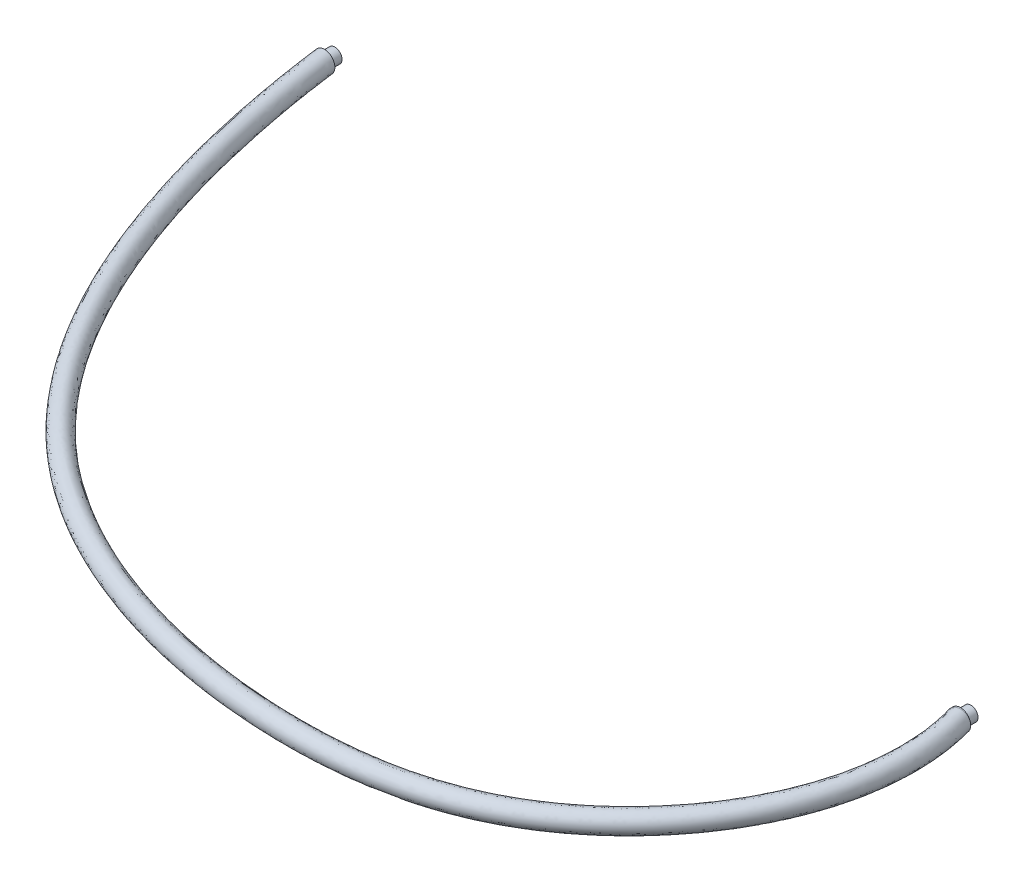
ISO-10303-21;
HEADER;
FILE_DESCRIPTION(('STEP AP214'),'2;1');
FILE_NAME('part.step','',(''),(''),'','','');
FILE_SCHEMA(('AUTOMOTIVE_DESIGN { 1 0 10303 214 1 1 1 1 }'));
ENDSEC;
DATA;
#1=APPLICATION_CONTEXT('core data for automotive mechanical design processes');
#2=APPLICATION_PROTOCOL_DEFINITION('international standard','automotive_design',2000,#1);
#3=PRODUCT_CONTEXT('',#1,'mechanical');
#4=PRODUCT('Part','Part','',(#3));
#5=PRODUCT_RELATED_PRODUCT_CATEGORY('part','',(#4));
#6=PRODUCT_DEFINITION_FORMATION('','',#4);
#7=PRODUCT_DEFINITION_CONTEXT('part definition',#1,'design');
#8=PRODUCT_DEFINITION('design','',#6,#7);
#9=PRODUCT_DEFINITION_SHAPE('','',#8);
#10=(LENGTH_UNIT() NAMED_UNIT(*) SI_UNIT(.MILLI.,.METRE.));
#11=(NAMED_UNIT(*) PLANE_ANGLE_UNIT() SI_UNIT($,.RADIAN.));
#12=(NAMED_UNIT(*) SI_UNIT($,.STERADIAN.) SOLID_ANGLE_UNIT());
#13=UNCERTAINTY_MEASURE_WITH_UNIT(LENGTH_MEASURE(1.E-05),#10,'distance_accuracy_value','');
#14=(GEOMETRIC_REPRESENTATION_CONTEXT(3) GLOBAL_UNCERTAINTY_ASSIGNED_CONTEXT((#13)) GLOBAL_UNIT_ASSIGNED_CONTEXT((#10,
#11,#12)) REPRESENTATION_CONTEXT('',''));
#15=CARTESIAN_POINT('',(0.,0.,0.));
#16=DIRECTION('',(0.,0.,1.));
#17=DIRECTION('',(1.,0.,0.));
#18=AXIS2_PLACEMENT_3D('',#15,#16,#17);
#19=CARTESIAN_POINT('',(170.,0.,48.5138712432312));
#20=DIRECTION('',(-0.136619633778921,0.,-0.990623579199543));
#21=DIRECTION('',(-0.990623579199543,0.,0.136619633778921));
#22=AXIS2_PLACEMENT_3D('',#19,#20,#21);
#23=PLANE('',#22);
#24=CARTESIAN_POINT('',(170.,0.,48.5138712432312));
#25=DIRECTION('',(-0.136619633778921,0.,-0.990623579199543));
#26=DIRECTION('',(-0.990623579199543,0.,0.136619633778921));
#27=AXIS2_PLACEMENT_3D('',#24,#25,#26);
#28=CIRCLE('',#27,2.);
#29=CARTESIAN_POINT('',(171.981247158399,0.,48.2406319756734));
#30=VERTEX_POINT('',#29);
#31=CARTESIAN_POINT('',(168.018752841601,0.,48.787110510789));
#32=VERTEX_POINT('',#31);
#33=EDGE_CURVE('E151',#30,#32,#28,.T.);
#34=ORIENTED_EDGE('',*,*,#33,.T.);
#35=CARTESIAN_POINT('',(170.,0.,48.5138712432312));
#36=DIRECTION('',(-0.136619633778921,0.,-0.990623579199543));
#37=DIRECTION('',(-0.990623579199543,0.,0.136619633778921));
#38=AXIS2_PLACEMENT_3D('',#35,#36,#37);
#39=ELLIPSE('',#38,2.,1.98124715839909);
#40=EDGE_CURVE('E142',#32,#30,#39,.F.);
#41=ORIENTED_EDGE('',*,*,#40,.T.);
#42=EDGE_LOOP('',(#34,#41));
#43=FACE_BOUND('',#42,.T.);
#44=ADVANCED_FACE('F37',(#43),#23,.T.);
#45=EDGE_CURVE('E76',#32,#30,#28,.T.);
#46=ORIENTED_EDGE('',*,*,#45,.T.);
#47=EDGE_CURVE('E61',#30,#32,#39,.F.);
#48=ORIENTED_EDGE('',*,*,#47,.T.);
#49=EDGE_LOOP('',(#46,#48));
#50=FACE_BOUND('',#49,.T.);
#51=ADVANCED_FACE('F189',(#50),#23,.T.);
#52=CARTESIAN_POINT('',(2.,0.,0.));
#53=CARTESIAN_POINT('',(4.03678121718326,0.,15.4349529953382));
#54=CARTESIAN_POINT('',(7.74038145796709,0.,32.2604666144159));
#55=CARTESIAN_POINT('',(20.2268066674913,0.,63.5088357954978));
#56=CARTESIAN_POINT('',(29.0062569489979,0.,77.9131961174059));
#57=CARTESIAN_POINT('',(58.2609726492951,0.,103.735925052162));
#58=CARTESIAN_POINT('',(82.3703570695935,0.,111.743494555031));
#59=CARTESIAN_POINT('',(117.772972882631,0.,112.517204670343));
#60=CARTESIAN_POINT('',(129.216670453025,0.,110.946766152446));
#61=CARTESIAN_POINT('',(149.374018543372,0.,100.931526230273));
#62=CARTESIAN_POINT('',(158.234200443146,0.,92.2850748073562));
#63=CARTESIAN_POINT('',(166.419223702799,0.,76.9603412759029));
#64=CARTESIAN_POINT('',(168.298904103346,0.,71.4651662176905));
#65=CARTESIAN_POINT('',(169.892635365069,0.,60.2128754856595));
#66=CARTESIAN_POINT('',(169.610391378992,0.,54.4581876004669));
#67=CARTESIAN_POINT('',(168.018752841601,0.,48.787110510789));
#68=CARTESIAN_POINT('',(2.,4.,0.));
#69=CARTESIAN_POINT('',(4.03678121718326,4.,15.4349529953382));
#70=CARTESIAN_POINT('',(7.74038145796709,4.,32.2604666144159));
#71=CARTESIAN_POINT('',(20.2268066674913,4.,63.5088357954978));
#72=CARTESIAN_POINT('',(29.0062569489979,4.,77.9131961174059));
#73=CARTESIAN_POINT('',(58.2609726492951,4.,103.735925052162));
#74=CARTESIAN_POINT('',(82.3703570695935,4.,111.743494555031));
#75=CARTESIAN_POINT('',(117.772972882631,4.,112.517204670343));
#76=CARTESIAN_POINT('',(129.216670453025,4.,110.946766152446));
#77=CARTESIAN_POINT('',(149.374018543372,4.,100.931526230273));
#78=CARTESIAN_POINT('',(158.234200443146,4.,92.2850748073562));
#79=CARTESIAN_POINT('',(166.419223702799,4.,76.9603412759029));
#80=CARTESIAN_POINT('',(168.298904103346,4.,71.4651662176905));
#81=CARTESIAN_POINT('',(169.892635365069,4.,60.2128754856595));
#82=CARTESIAN_POINT('',(169.610391378992,4.,54.4581876004669));
#83=CARTESIAN_POINT('',(168.018752841601,4.,48.7871105107891));
#84=CARTESIAN_POINT('',(-2.,4.,0.));
#85=CARTESIAN_POINT('',(0.0367812171832601,4.,15.6857249737208));
#86=CARTESIAN_POINT('',(3.75444125507808,4.,32.8150709116087));
#87=CARTESIAN_POINT('',(16.4580735908133,4.,64.9202025884204));
#88=CARTESIAN_POINT('',(25.4474205758466,4.,79.9144835697773));
#89=CARTESIAN_POINT('',(55.9971164125199,4.,107.23113249232));
#90=CARTESIAN_POINT('',(80.9292878993275,4.,115.567456717026));
#91=CARTESIAN_POINT('',(117.564030998263,4.,116.532797247824));
#92=CARTESIAN_POINT('',(129.668953691141,4.,115.01614950974));
#93=CARTESIAN_POINT('',(151.497604649552,4.,104.436120534219));
#94=CARTESIAN_POINT('',(160.976735505194,4.,95.3195746830862));
#95=CARTESIAN_POINT('',(169.911978989104,4.,78.9561074257475));
#96=CARTESIAN_POINT('',(172.007603773496,4.,73.0479314057665));
#97=CARTESIAN_POINT('',(173.879688125562,4.,60.8153779073417));
#98=CARTESIAN_POINT('',(173.652442544075,4.,54.4885726385583));
#99=CARTESIAN_POINT('',(171.981247158399,4.,48.2406319756734));
#100=CARTESIAN_POINT('',(-2.,0.,0.));
#101=CARTESIAN_POINT('',(0.0367812171832597,0.,15.6857249737208));
#102=CARTESIAN_POINT('',(3.75444125507808,0.,32.8150709115792));
#103=CARTESIAN_POINT('',(16.4580735908133,0.,64.92020258845));
#104=CARTESIAN_POINT('',(25.4474205758466,0.,79.9144835697773));
#105=CARTESIAN_POINT('',(55.9971164125199,0.,107.23113249232));
#106=CARTESIAN_POINT('',(80.9292878993275,0.,115.567456717026));
#107=CARTESIAN_POINT('',(117.564030998263,0.,116.532797247824));
#108=CARTESIAN_POINT('',(129.668953691141,0.,115.01614950974));
#109=CARTESIAN_POINT('',(151.497604649552,0.,104.436120534219));
#110=CARTESIAN_POINT('',(160.976735505194,0.,95.3195746830862));
#111=CARTESIAN_POINT('',(169.911978989104,0.,78.9561074257475));
#112=CARTESIAN_POINT('',(172.007603773496,0.,73.0479314057665));
#113=CARTESIAN_POINT('',(173.879688125562,0.,60.8153779073417));
#114=CARTESIAN_POINT('',(173.652442544075,0.,54.4885726385583));
#115=CARTESIAN_POINT('',(171.981247158399,0.,48.2406319756734));
#116=CARTESIAN_POINT('',(-2.,-4.,0.));
#117=CARTESIAN_POINT('',(0.0367812171832593,-4.,15.6857249737208));
#118=CARTESIAN_POINT('',(3.75444125507808,-4.,32.8150709115496));
#119=CARTESIAN_POINT('',(16.4580735908133,-4.,64.9202025884796));
#120=CARTESIAN_POINT('',(25.4474205758466,-4.,79.9144835697773));
#121=CARTESIAN_POINT('',(55.9971164125199,-4.,107.23113249232));
#122=CARTESIAN_POINT('',(80.9292878993275,-4.,115.567456717026));
#123=CARTESIAN_POINT('',(117.564030998263,-4.,116.532797247824));
#124=CARTESIAN_POINT('',(129.668953691141,-4.,115.01614950974));
#125=CARTESIAN_POINT('',(151.497604649552,-4.,104.436120534219));
#126=CARTESIAN_POINT('',(160.976735505194,-4.,95.3195746830862));
#127=CARTESIAN_POINT('',(169.911978989104,-4.,78.9561074257475));
#128=CARTESIAN_POINT('',(172.007603773496,-4.,73.0479314057665));
#129=CARTESIAN_POINT('',(173.879688125562,-4.,60.8153779073417));
#130=CARTESIAN_POINT('',(173.652442544075,-4.,54.4885726385583));
#131=CARTESIAN_POINT('',(171.981247158399,-4.,48.2406319756734));
#132=CARTESIAN_POINT('',(2.,-4.,0.));
#133=CARTESIAN_POINT('',(4.03678121718326,-4.,15.4349529953382));
#134=CARTESIAN_POINT('',(7.74038145796709,-4.,32.2604666144159));
#135=CARTESIAN_POINT('',(20.2268066674913,-4.,63.5088357954978));
#136=CARTESIAN_POINT('',(29.0062569489979,-4.,77.9131961174059));
#137=CARTESIAN_POINT('',(58.2609726492951,-4.,103.735925052162));
#138=CARTESIAN_POINT('',(82.3703570695935,-4.,111.743494555031));
#139=CARTESIAN_POINT('',(117.772972882631,-4.,112.517204670343));
#140=CARTESIAN_POINT('',(129.216670453025,-4.,110.946766152446));
#141=CARTESIAN_POINT('',(149.374018543372,-4.,100.931526230273));
#142=CARTESIAN_POINT('',(158.234200443146,-4.,92.2850748073562));
#143=CARTESIAN_POINT('',(166.419223702799,-4.,76.9603412759029));
#144=CARTESIAN_POINT('',(168.298904103346,-4.,71.4651662176905));
#145=CARTESIAN_POINT('',(169.892635365069,-4.,60.2128754856595));
#146=CARTESIAN_POINT('',(169.610391378992,-4.,54.4581876004669));
#147=CARTESIAN_POINT('',(168.018752841601,-4.,48.7871105107891));
#148=CARTESIAN_POINT('',(2.,0.,0.));
#149=CARTESIAN_POINT('',(4.03678121718326,0.,15.4349529953382));
#150=CARTESIAN_POINT('',(7.74038145796709,0.,32.2604666144159));
#151=CARTESIAN_POINT('',(20.2268066674913,0.,63.5088357954978));
#152=CARTESIAN_POINT('',(29.0062569489979,0.,77.9131961174059));
#153=CARTESIAN_POINT('',(58.2609726492951,0.,103.735925052162));
#154=CARTESIAN_POINT('',(82.3703570695935,0.,111.743494555031));
#155=CARTESIAN_POINT('',(117.772972882631,0.,112.517204670343));
#156=CARTESIAN_POINT('',(129.216670453025,0.,110.946766152446));
#157=CARTESIAN_POINT('',(149.374018543372,0.,100.931526230273));
#158=CARTESIAN_POINT('',(158.234200443146,0.,92.2850748073562));
#159=CARTESIAN_POINT('',(166.419223702799,0.,76.9603412759029));
#160=CARTESIAN_POINT('',(168.298904103346,0.,71.4651662176905));
#161=CARTESIAN_POINT('',(169.892635365069,0.,60.2128754856595));
#162=CARTESIAN_POINT('',(169.610391378992,0.,54.4581876004669));
#163=CARTESIAN_POINT('',(168.018752841601,0.,48.787110510789));
#164=(BOUNDED_SURFACE() B_SPLINE_SURFACE(3,3,((#52,#53,#54,#55,#56,#57,#58,#59,#60,#61,#62,#63,
#64,#65,#66,#67),(#68,#69,#70,#71,#72,#73,#74,#75,#76,#77,#78,#79,#80,#81,#82,#83),(#84,#85,#86,
#87,#88,#89,#90,#91,#92,#93,#94,#95,#96,#97,#98,#99),(#100,#101,#102,#103,#104,#105,#106,#107,
#108,#109,#110,#111,#112,#113,#114,#115),(#116,#117,#118,#119,#120,#121,#122,#123,#124,#125,
#126,#127,#128,#129,#130,#131),(#132,#133,#134,#135,#136,#137,#138,#139,#140,#141,#142,#143,
#144,#145,#146,#147),(#148,#149,#150,#151,#152,#153,#154,#155,#156,#157,#158,#159,#160,#161,
#162,#163)),.UNSPECIFIED.,.T.,.F.,.F.) B_SPLINE_SURFACE_WITH_KNOTS((4,3,4),(4,2,2,2,2,2,2,4),
(0.,0.5,1.),(0.,0.181061760460168,0.362123520920336,0.618239320667053,0.74400574120655,
0.872002870603275,0.936001435301638,1.),
.UNSPECIFIED.) GEOMETRIC_REPRESENTATION_ITEM() RATIONAL_B_SPLINE_SURFACE(((1.,1.,1.,1.,1.,1.,1.,
1.,1.,1.,1.,1.,1.,1.,1.,1.),(0.333333333333333,0.333333333333333,0.333333333333333,
0.333333333333333,0.333333333333333,0.333333333333333,0.333333333333333,0.333333333333333,
0.333333333333333,0.333333333333333,0.333333333333333,0.333333333333333,0.333333333333333,
0.333333333333333,0.333333333333333,0.333333333333333),(0.333333333333333,0.333333333333333,
0.333333333333333,0.333333333333333,0.333333333333333,0.333333333333333,0.333333333333333,
0.333333333333333,0.333333333333333,0.333333333333333,0.333333333333333,0.333333333333333,
0.333333333333333,0.333333333333333,0.333333333333333,0.333333333333333),(1.,1.,1.,1.,1.,1.,1.,
1.,1.,1.,1.,1.,1.,1.,1.,1.),(0.333333333333333,0.333333333333333,0.333333333333333,
0.333333333333333,0.333333333333333,0.333333333333333,0.333333333333333,0.333333333333333,
0.333333333333333,0.333333333333333,0.333333333333333,0.333333333333333,0.333333333333333,
0.333333333333333,0.333333333333333,0.333333333333333),(0.333333333333333,0.333333333333333,
0.333333333333333,0.333333333333333,0.333333333333333,0.333333333333333,0.333333333333333,
0.333333333333333,0.333333333333333,0.333333333333333,0.333333333333333,0.333333333333333,
0.333333333333333,0.333333333333333,0.333333333333333,0.333333333333333),(1.,1.,1.,1.,1.,1.,1.,
1.,1.,1.,1.,1.,1.,1.,1.,1.))) REPRESENTATION_ITEM('') SURFACE());
#165=CARTESIAN_POINT('',(0.,0.,0.));
#166=DIRECTION('',(0.,0.,1.));
#167=DIRECTION('',(1.,0.,0.));
#168=AXIS2_PLACEMENT_3D('',#165,#166,#167);
#169=CIRCLE('',#168,2.);
#170=CARTESIAN_POINT('',(2.,0.,0.));
#171=VERTEX_POINT('',#170);
#172=EDGE_CURVE('E146',#171,#171,#169,.T.);
#173=CARTESIAN_POINT('',(168.018752841601,0.,48.7871105107891));
#174=CARTESIAN_POINT('',(168.018753025546,0.055680935510857,48.7871114506702));
#175=CARTESIAN_POINT('',(168.021101553189,0.111335245177061,48.7869487047243));
#176=CARTESIAN_POINT('',(168.030470156626,0.222244202020412,48.7863058905508));
#177=CARTESIAN_POINT('',(168.037489968004,0.277498871640082,48.7858258402842));
#178=CARTESIAN_POINT('',(168.065484154413,0.441948503092558,48.7839271418927));
#179=CARTESIAN_POINT('',(168.093393501391,0.550039442289777,48.7820498726117));
#180=CARTESIAN_POINT('',(168.166923323685,0.759972378781213,48.7773109193633));
#181=CARTESIAN_POINT('',(168.212548924382,0.861812557822803,48.7744489505458));
#182=CARTESIAN_POINT('',(168.320215029269,1.05642502159636,48.768214312127));
#183=CARTESIAN_POINT('',(168.382259832644,1.14919492265185,48.7648415088683));
#184=CARTESIAN_POINT('',(168.521246554258,1.32327115524086,48.7583987161232));
#185=CARTESIAN_POINT('',(168.598223698518,1.40454957823976,48.7553294691104));
#186=CARTESIAN_POINT('',(168.722986035738,1.51581423103237,48.7522497731847));
#187=CARTESIAN_POINT('',(168.766118894673,1.55112442654378,48.7514772378765));
#188=CARTESIAN_POINT('',(168.855202863464,1.61798444507374,48.75083343572));
#189=CARTESIAN_POINT('',(168.901152344806,1.6495364105377,48.7509616528569));
#190=CARTESIAN_POINT('',(168.979895505522,1.69885732119239,48.7524368434432));
#191=CARTESIAN_POINT('',(169.012010880256,1.71773215565166,48.753366466402));
#192=CARTESIAN_POINT('',(169.077206302428,1.75361775999528,48.7561899721351));
#193=CARTESIAN_POINT('',(169.110285782518,1.77062959923463,48.7580832981835));
#194=CARTESIAN_POINT('',(169.177295087791,1.80274162894515,48.7632467271723));
#195=CARTESIAN_POINT('',(169.211225490877,1.81784047564678,48.7665177909973));
#196=CARTESIAN_POINT('',(169.262576326819,1.8389916432571,48.7729314163785));
#197=CARTESIAN_POINT('',(169.279782424908,1.84579712759049,48.775322860582));
#198=CARTESIAN_POINT('',(169.314298930537,1.85889637876728,48.7807241291742));
#199=CARTESIAN_POINT('',(169.331609374793,1.86518995264951,48.7837341852504));
#200=CARTESIAN_POINT('',(169.348945928845,1.87122123200261,48.7871105107886));
#201=B_SPLINE_CURVE_WITH_KNOTS('',3,(#173,#174,#175,#176,#177,#178,#179,#180,#181,#182,#183,
#184,#185,#186,#187,#188,#189,#190,#191,#192,#193,#194,#195,#196,#197,#198,#199,#200),
.UNSPECIFIED.,.F.,.F.,(4,2,2,2,2,2,2,2,2,2,2,2,2,4),(0.,0.166940211048649,0.333870973316103,
0.667109486489421,1.00044447880245,1.33386683768013,1.66808553533646,1.83516674608772,
2.00215224870897,2.1138790569351,2.22554139432214,2.33728173839595,2.39323722526489,
2.44921370735805),.UNSPECIFIED.);
#202=CARTESIAN_POINT('',(169.348945928845,1.87122123200261,48.787110510789));
#203=VERTEX_POINT('',#202);
#204=EDGE_CURVE('E47',#32,#203,#201,.T.);
#205=CARTESIAN_POINT('',(172.0050221243,0.670975022129245,48.7871105107891));
#206=CARTESIAN_POINT('',(171.985752890154,0.723823423758103,48.787110510789));
#207=CARTESIAN_POINT('',(171.96422481094,0.775819741544335,48.787110510789));
#208=CARTESIAN_POINT('',(171.916824511169,0.877780535734431,48.787110510789));
#209=CARTESIAN_POINT('',(171.890953174441,0.927745422959193,48.787110510789));
#210=CARTESIAN_POINT('',(171.807209459919,1.07389234555639,48.787110510789));
#211=CARTESIAN_POINT('',(171.743110475461,1.16659079025429,48.7871105107891));
#212=CARTESIAN_POINT('',(171.600331746219,1.33995288352335,48.7871105107891));
#213=CARTESIAN_POINT('',(171.521652525712,1.42061696463848,48.787110510789));
#214=CARTESIAN_POINT('',(171.394569793841,1.53098857811022,48.787110510789));
#215=CARTESIAN_POINT('',(171.35068577512,1.56601600843295,48.787110510789));
#216=CARTESIAN_POINT('',(171.260148904673,1.63237715221139,48.787110510789));
#217=CARTESIAN_POINT('',(171.21349363212,1.66370756262205,48.7871105107891));
#218=CARTESIAN_POINT('',(171.068373380416,1.75274270392007,48.7871105107891));
#219=CARTESIAN_POINT('',(170.966076844789,1.80434366119535,48.787110510789));
#220=CARTESIAN_POINT('',(170.754396319808,1.89004948913979,48.787110510789));
#221=CARTESIAN_POINT('',(170.645011153163,1.92415144511606,48.7871105107891));
#222=CARTESIAN_POINT('',(170.476683964002,1.96190159577307,48.7871105107891));
#223=CARTESIAN_POINT('',(170.41918148663,1.97228972890229,48.787110510789));
#224=CARTESIAN_POINT('',(170.303569326965,1.98823982565281,48.787110510789));
#225=CARTESIAN_POINT('',(170.245460280142,1.99380640986951,48.787110510789));
#226=CARTESIAN_POINT('',(170.0706962519,2.00322234561755,48.787110510789));
#227=CARTESIAN_POINT('',(169.953564926343,1.99979667529845,48.7871105107891));
#228=CARTESIAN_POINT('',(169.72003053817,1.9734466175634,48.7871105107891));
#229=CARTESIAN_POINT('',(169.603657136127,1.95026728556923,48.7871105107891));
#230=CARTESIAN_POINT('',(169.376388392844,1.88461386524921,48.787110510789));
#231=CARTESIAN_POINT('',(169.265493271979,1.84213900142268,48.787110510789));
#232=CARTESIAN_POINT('',(169.106011022349,1.7649183668948,48.787110510789));
#233=CARTESIAN_POINT('',(169.054036753781,1.7369575414141,48.787110510789));
#234=CARTESIAN_POINT('',(168.952663943389,1.67670116970593,48.787110510789));
#235=CARTESIAN_POINT('',(168.903264734647,1.6444067536616,48.787110510789));
#236=CARTESIAN_POINT('',(168.807451491825,1.57570806042364,48.787110510789));
#237=CARTESIAN_POINT('',(168.761035856747,1.53930601678953,48.787110510789));
#238=CARTESIAN_POINT('',(168.67148560322,1.46259522346712,48.787110510789));
#239=CARTESIAN_POINT('',(168.628354548887,1.42228233495547,48.787110510789));
#240=CARTESIAN_POINT('',(168.506117471919,1.29757956895023,48.787110510789));
#241=CARTESIAN_POINT('',(168.432185207411,1.20799979282858,48.7871105107891));
#242=CARTESIAN_POINT('',(168.30094711139,1.01740301315823,48.787110510789));
#243=CARTESIAN_POINT('',(168.243636388898,0.916389386271141,48.787110510789));
#244=CARTESIAN_POINT('',(168.172231967774,0.760000653114707,48.787110510789));
#245=CARTESIAN_POINT('',(168.151042474802,0.707767333321982,48.787110510789));
#246=CARTESIAN_POINT('',(168.113240135915,0.601699524838859,48.7871105107891));
#247=CARTESIAN_POINT('',(168.096623711734,0.547866324755352,48.787110510789));
#248=CARTESIAN_POINT('',(168.068119581578,0.439047015904446,48.787110510789));
#249=CARTESIAN_POINT('',(168.056225404915,0.384062594196593,48.7871105107891));
#250=CARTESIAN_POINT('',(168.037237168005,0.273283646769807,48.787110510789));
#251=CARTESIAN_POINT('',(168.030141239691,0.21748944496805,48.787110510789));
#252=CARTESIAN_POINT('',(168.023233047531,0.134630666576827,48.787110510789));
#253=CARTESIAN_POINT('',(168.021552006593,0.107710184581874,48.787110510789));
#254=CARTESIAN_POINT('',(168.019312719664,0.0538609163799517,48.7871105107891));
#255=CARTESIAN_POINT('',(168.018752880278,0.0269321964306496,48.7871105107891));
#256=CARTESIAN_POINT('',(168.018752841601,0.,48.787110510789));
#257=B_SPLINE_CURVE_WITH_KNOTS('',3,(#205,#206,#207,#208,#209,#210,#211,#212,#213,#214,#215,
#216,#217,#218,#219,#220,#221,#222,#223,#224,#225,#226,#227,#228,#229,#230,#231,#232,#233,#234,
#235,#236,#237,#238,#239,#240,#241,#242,#243,#244,#245,#246,#247,#248,#249,#250,#251,#252,#253,
#254,#255,#256),.UNSPECIFIED.,.F.,.F.,(4,2,2,2,2,2,2,2,2,2,2,2,2,2,2,2,2,2,2,2,2,2,2,2,2,4),(0.,
0.16865146078965,0.337268643410378,0.673669953109361,1.01005916882191,1.17834039151052,
1.34677084199391,1.68882089130809,2.03092789515803,2.206047943128,2.38099998346985,
2.73078428822737,3.08515255628555,3.43953506790796,3.61641277099516,3.79324443441042,
3.96998040319673,4.14690549445088,4.49352801463717,4.84004843552044,5.00897912852297,
5.17777726093053,5.34634329179148,5.5148436582856,5.59574254496747,5.67652638046789),.UNSPECIFIED.);
#258=EDGE_CURVE('E69',#203,#32,#257,.T.);
#259=CARTESIAN_POINT('',(168.018752841601,0.,48.787110510789));
#260=CARTESIAN_POINT('',(168.018751464122,-0.0551253382194834,48.787110510789));
#261=CARTESIAN_POINT('',(168.021099176925,-0.110225734253967,48.787110510789));
#262=CARTESIAN_POINT('',(168.030458144178,-0.220020457590565,48.787110510789));
#263=CARTESIAN_POINT('',(168.037468673018,-0.274714846735181,48.787110510789));
#264=CARTESIAN_POINT('',(168.065399360264,-0.437422712298417,48.787110510789));
#265=CARTESIAN_POINT('',(168.093218990462,-0.544325929293093,48.7871105107891));
#266=CARTESIAN_POINT('',(168.16639226257,-0.751961005457131,48.7871105107891));
#267=CARTESIAN_POINT('',(168.21174906534,-0.852691748320157,48.787110510789));
#268=CARTESIAN_POINT('',(168.291750299083,-0.997010870856734,48.787110510789));
#269=CARTESIAN_POINT('',(168.320419621609,-1.04399769161661,48.787110510789));
#270=CARTESIAN_POINT('',(168.381561386539,-1.13548682962427,48.787110510789));
#271=CARTESIAN_POINT('',(168.414037095511,-1.17998696376827,48.787110510789));
#272=CARTESIAN_POINT('',(168.517618227855,-1.31029442712498,48.787110510789));
#273=CARTESIAN_POINT('',(168.594257828691,-1.39179325526381,48.7871105107891));
#274=CARTESIAN_POINT('',(168.759836240577,-1.54116155618067,48.787110510789));
#275=CARTESIAN_POINT('',(168.848777646045,-1.60902814653172,48.787110510789));
#276=CARTESIAN_POINT('',(168.990702986388,-1.70018016903418,48.787110510789));
#277=CARTESIAN_POINT('',(169.040149416579,-1.72910001104664,48.787110510789));
#278=CARTESIAN_POINT('',(169.141210237486,-1.78273312945267,48.7871105107891));
#279=CARTESIAN_POINT('',(169.192822495114,-1.80745042900806,48.7871105107891));
#280=CARTESIAN_POINT('',(169.350490791486,-1.87511688352834,48.787110510789));
#281=CARTESIAN_POINT('',(169.459407389186,-1.91159916991622,48.787110510789));
#282=CARTESIAN_POINT('',(169.684273300442,-1.96698638767054,48.787110510789));
#283=CARTESIAN_POINT('',(169.800327763478,-1.98545780263986,48.787110510789));
#284=CARTESIAN_POINT('',(170.033978138599,-2.00287305350826,48.7871105107891));
#285=CARTESIAN_POINT('',(170.151574211995,-2.00181482929532,48.7871105107891));
#286=CARTESIAN_POINT('',(170.327109218283,-1.98554855131879,48.7871105107891));
#287=CARTESIAN_POINT('',(170.385807683881,-1.977592363718,48.787110510789));
#288=CARTESIAN_POINT('',(170.502323527563,-1.95675023012234,48.787110510789));
#289=CARTESIAN_POINT('',(170.560141118766,-1.94386549687687,48.787110510789));
#290=CARTESIAN_POINT('',(170.674448735836,-1.91324440500369,48.787110510789));
#291=CARTESIAN_POINT('',(170.730939361665,-1.89551028662644,48.787110510789));
#292=CARTESIAN_POINT('',(170.842253550945,-1.85528605501457,48.787110510789));
#293=CARTESIAN_POINT('',(170.89707530611,-1.83279097919142,48.787110510789));
#294=CARTESIAN_POINT('',(171.05758564649,-1.75872434000215,48.787110510789));
#295=CARTESIAN_POINT('',(171.160220180665,-1.70032930608839,48.7871105107891));
#296=CARTESIAN_POINT('',(171.353936909482,-1.56679232272981,48.787110510789));
#297=CARTESIAN_POINT('',(171.445021820527,-1.49165432264008,48.787110510789));
#298=CARTESIAN_POINT('',(171.57000412164,-1.36881167313649,48.787110510789));
#299=CARTESIAN_POINT('',(171.609420823664,-1.32659752641212,48.787110510789));
#300=CARTESIAN_POINT('',(171.684460477001,-1.2389596953491,48.7871105107891));
#301=CARTESIAN_POINT('',(171.720086408915,-1.19353858003613,48.7871105107891));
#302=CARTESIAN_POINT('',(171.787231573917,-1.09985081665562,48.787110510789));
#303=CARTESIAN_POINT('',(171.818756047576,-1.05158791654546,48.787110510789));
#304=CARTESIAN_POINT('',(171.877489496625,-0.95251777338347,48.7871105107891));
#305=CARTESIAN_POINT('',(171.904700035579,-0.901711461004237,48.7871105107891));
#306=CARTESIAN_POINT('',(171.943669713715,-0.820635966709213,48.7871105107891));
#307=CARTESIAN_POINT('',(171.956981669453,-0.791103297870211,48.7871105107891));
#308=CARTESIAN_POINT('',(171.982117508391,-0.731463872335218,48.787110510789));
#309=CARTESIAN_POINT('',(171.9939436072,-0.701358049377906,48.787110510789));
#310=CARTESIAN_POINT('',(172.0050221243,-0.670975022129139,48.787110510789));
#311=B_SPLINE_CURVE_WITH_KNOTS('',3,(#259,#260,#261,#262,#263,#264,#265,#266,#267,#268,#269,
#270,#271,#272,#273,#274,#275,#276,#277,#278,#279,#280,#281,#282,#283,#284,#285,#286,#287,#288,
#289,#290,#291,#292,#293,#294,#295,#296,#297,#298,#299,#300,#301,#302,#303,#304,#305,#306,#307,
#308,#309,#310),.UNSPECIFIED.,.F.,.F.,(4,2,2,2,2,2,2,2,2,2,2,2,2,2,2,2,2,2,2,2,2,2,2,2,2,4),(0.,
0.165276781455829,0.330527849132909,0.660245204172093,0.990022014434217,1.15498570178266,
1.32009200888095,1.65408573780616,1.98815001285162,2.15982444713511,2.33133359787811,
2.67424974860792,3.02522978276256,3.37624684076169,3.55377818399883,3.73126587081275,
3.90867170248808,4.08626337213996,4.4386846856996,4.79102295744321,4.96411265856216,
5.13706524133778,5.30979461984606,5.48246124960578,5.57960888888817,5.67660990428501),.UNSPECIFIED.);
#312=CARTESIAN_POINT('',(169.348945928847,-1.87122123200312,48.787110510789));
#313=VERTEX_POINT('',#312);
#314=EDGE_CURVE('E41',#32,#313,#311,.T.);
#315=CARTESIAN_POINT('',(169.348945928846,-1.87122123200295,48.7871105107891));
#316=CARTESIAN_POINT('',(169.325015732023,-1.86289766904868,48.7824606858889));
#317=CARTESIAN_POINT('',(169.301141452622,-1.85407414726711,48.7784931365355));
#318=CARTESIAN_POINT('',(169.253629804465,-1.83546174434569,48.7716574865774));
#319=CARTESIAN_POINT('',(169.22999228549,-1.82567352448944,48.7687886393323));
#320=CARTESIAN_POINT('',(169.183087246584,-1.80517274576309,48.7638839644629));
#321=CARTESIAN_POINT('',(169.15981915383,-1.79446182684497,48.7618466943807));
#322=CARTESIAN_POINT('',(169.113675328588,-1.77212476379073,48.7584169417097));
#323=CARTESIAN_POINT('',(169.090799671567,-1.76049844596739,48.7570245818324));
#324=CARTESIAN_POINT('',(169.022985820933,-1.72435520883723,48.7536005227036));
#325=CARTESIAN_POINT('',(168.978710657059,-1.69850841847658,48.7523082233406));
#326=CARTESIAN_POINT('',(168.892274598933,-1.6434457154092,48.7509389860628));
#327=CARTESIAN_POINT('',(168.850114715406,-1.6142282136944,48.7508626237381));
#328=CARTESIAN_POINT('',(168.768493671601,-1.55284225668376,48.7514678002878));
#329=CARTESIAN_POINT('',(168.729014755801,-1.52069739130521,48.7521437006865));
#330=CARTESIAN_POINT('',(168.652666928202,-1.4534865985858,48.7539515850066));
#331=CARTESIAN_POINT('',(168.615797568099,-1.41842117524111,48.7550834903648));
#332=CARTESIAN_POINT('',(168.509374432419,-1.30908607520238,48.7588515070718));
#333=CARTESIAN_POINT('',(168.444001527944,-1.23067449995077,48.7618599944189));
#334=CARTESIAN_POINT('',(168.32073319616,-1.05722988546113,48.768138272874));
#335=CARTESIAN_POINT('',(168.264054046657,-0.961334296644341,48.7714070108067));
#336=CARTESIAN_POINT('',(168.167520236256,-0.761366812553527,48.777248659048));
#337=CARTESIAN_POINT('',(168.127666569497,-0.657294434581387,48.7798215282376));
#338=CARTESIAN_POINT('',(168.070952835203,-0.461272000837353,48.7835545367179));
#339=CARTESIAN_POINT('',(168.05141380072,-0.370089240483883,48.7848760114787));
#340=CARTESIAN_POINT('',(168.025298869651,-0.185948245148113,48.7866603116267));
#341=CARTESIAN_POINT('',(168.018713390134,-0.0929913740826691,48.7871237717509));
#342=CARTESIAN_POINT('',(168.018752841601,0.,48.787110510789));
#343=B_SPLINE_CURVE_WITH_KNOTS('',3,(#315,#316,#317,#318,#319,#320,#321,#322,#323,#324,#325,
#326,#327,#328,#329,#330,#331,#332,#333,#334,#335,#336,#337,#338,#339,#340,#341,#342),
.UNSPECIFIED.,.F.,.F.,(4,2,2,2,2,2,2,2,2,2,2,2,2,4),(0.,0.0772454036658362,0.154438220450045,
0.231496563284694,0.308569562519109,0.462224206078936,0.615951583223624,0.768534432829583,
0.921091005790007,1.22618901326402,1.55896384490363,1.89175833592858,2.17064264464623,
2.44932055942112),.UNSPECIFIED.);
#344=EDGE_CURVE('E82',#313,#32,#343,.T.);
#345=ORIENTED_EDGE('',*,*,#172,.T.);
#346=EDGE_LOOP('',(#345));
#347=FACE_BOUND('',#346,.T.);
#348=ORIENTED_EDGE('',*,*,#45,.F.);
#349=ORIENTED_EDGE('',*,*,#204,.T.);
#350=ORIENTED_EDGE('',*,*,#258,.T.);
#351=ORIENTED_EDGE('',*,*,#314,.T.);
#352=ORIENTED_EDGE('',*,*,#344,.T.);
#353=ORIENTED_EDGE('',*,*,#33,.F.);
#354=EDGE_LOOP('',(#348,#349,#350,#351,#352,#353));
#355=FACE_BOUND('',#354,.T.);
#356=ADVANCED_FACE('F79',(#347,#355),#164,.T.);
#357=CARTESIAN_POINT('',(0.,0.,0.));
#358=DIRECTION('',(0.,0.,1.));
#359=DIRECTION('',(1.,0.,0.));
#360=AXIS2_PLACEMENT_3D('',#357,#358,#359);
#361=PLANE('',#360);
#362=CARTESIAN_POINT('',(0.,0.,0.));
#363=DIRECTION('',(0.,0.,1.));
#364=DIRECTION('',(1.,0.,0.));
#365=AXIS2_PLACEMENT_3D('',#362,#363,#364);
#366=CIRCLE('',#365,1.375);
#367=CARTESIAN_POINT('',(1.375,0.,0.));
#368=VERTEX_POINT('',#367);
#369=EDGE_CURVE('E141',#368,#368,#366,.T.);
#370=ORIENTED_EDGE('',*,*,#369,.T.);
#371=EDGE_LOOP('',(#370));
#372=FACE_BOUND('',#371,.T.);
#373=ORIENTED_EDGE('',*,*,#172,.F.);
#374=EDGE_LOOP('',(#373));
#375=FACE_BOUND('',#374,.T.);
#376=ADVANCED_FACE('F39',(#372,#375),#361,.F.);
#377=CARTESIAN_POINT('',(0.,0.,-2.));
#378=DIRECTION('',(0.,0.,1.));
#379=DIRECTION('',(1.,0.,0.));
#380=AXIS2_PLACEMENT_3D('',#377,#378,#379);
#381=CYLINDRICAL_SURFACE('',#380,1.375);
#382=CARTESIAN_POINT('',(0.,0.,-2.));
#383=DIRECTION('',(0.,0.,1.));
#384=DIRECTION('',(1.,0.,0.));
#385=AXIS2_PLACEMENT_3D('',#382,#383,#384);
#386=CIRCLE('',#385,1.375);
#387=CARTESIAN_POINT('',(1.375,0.,-2.));
#388=VERTEX_POINT('',#387);
#389=EDGE_CURVE('E143',#388,#388,#386,.T.);
#390=ORIENTED_EDGE('',*,*,#389,.T.);
#391=EDGE_LOOP('',(#390));
#392=FACE_BOUND('',#391,.T.);
#393=ORIENTED_EDGE('',*,*,#369,.F.);
#394=EDGE_LOOP('',(#393));
#395=FACE_BOUND('',#394,.T.);
#396=ADVANCED_FACE('F277',(#392,#395),#381,.T.);
#397=CARTESIAN_POINT('',(0.,0.,-2.));
#398=DIRECTION('',(0.,0.,1.));
#399=DIRECTION('',(1.,0.,0.));
#400=AXIS2_PLACEMENT_3D('',#397,#398,#399);
#401=PLANE('',#400);
#402=ORIENTED_EDGE('',*,*,#389,.F.);
#403=EDGE_LOOP('',(#402));
#404=FACE_BOUND('',#403,.T.);
#405=ADVANCED_FACE('F225',(#404),#401,.F.);
#406=CARTESIAN_POINT('',(170.,0.,48.7035012907996));
#407=DIRECTION('',(0.,0.,1.));
#408=DIRECTION('',(1.,0.,0.));
#409=AXIS2_PLACEMENT_3D('',#406,#407,#408);
#410=CYLINDRICAL_SURFACE('',#409,1.98124715839909);
#411=ORIENTED_EDGE('',*,*,#204,.F.);
#412=ORIENTED_EDGE('',*,*,#258,.F.);
#413=EDGE_LOOP('',(#411,#412));
#414=FACE_BOUND('',#413,.T.);
#415=ADVANCED_FACE('F72',(#414),#410,.T.);
#416=ORIENTED_EDGE('',*,*,#344,.F.);
#417=ORIENTED_EDGE('',*,*,#314,.F.);
#418=EDGE_LOOP('',(#416,#417));
#419=FACE_BOUND('',#418,.T.);
#420=ADVANCED_FACE('F109',(#419),#410,.T.);
#421=ORIENTED_EDGE('',*,*,#40,.F.);
#422=ORIENTED_EDGE('',*,*,#47,.F.);
#423=CARTESIAN_POINT('',(170.,0.,48.2406319756734));
#424=DIRECTION('',(0.,0.,1.));
#425=DIRECTION('',(1.,0.,0.));
#426=AXIS2_PLACEMENT_3D('',#423,#424,#425);
#427=CIRCLE('',#426,1.98124715839909);
#428=EDGE_CURVE('E181',#30,#30,#427,.T.);
#429=ORIENTED_EDGE('',*,*,#428,.T.);
#430=EDGE_LOOP('',(#421,#422,#429));
#431=FACE_BOUND('',#430,.T.);
#432=ADVANCED_FACE('F114',(#431),#410,.T.);
#433=CARTESIAN_POINT('',(168.018752841601,0.,48.2406319756734));
#434=DIRECTION('',(0.,0.,1.));
#435=DIRECTION('',(1.,0.,0.));
#436=AXIS2_PLACEMENT_3D('',#433,#434,#435);
#437=PLANE('',#436);
#438=ORIENTED_EDGE('',*,*,#428,.F.);
#439=EDGE_LOOP('',(#438));
#440=FACE_BOUND('',#439,.T.);
#441=CARTESIAN_POINT('',(170.,0.,48.2406319756734));
#442=DIRECTION('',(0.,0.,1.));
#443=DIRECTION('',(1.,0.,0.));
#444=AXIS2_PLACEMENT_3D('',#441,#442,#443);
#445=CIRCLE('',#444,1.37499999999999);
#446=CARTESIAN_POINT('',(171.375,0.,48.2406319756734));
#447=VERTEX_POINT('',#446);
#448=EDGE_CURVE('E11',#447,#447,#445,.T.);
#449=ORIENTED_EDGE('',*,*,#448,.T.);
#450=EDGE_LOOP('',(#449));
#451=FACE_BOUND('',#450,.T.);
#452=ADVANCED_FACE('F115',(#440,#451),#437,.F.);
#453=CARTESIAN_POINT('',(168.625,2.001,46.2406319756734));
#454=DIRECTION('',(0.,0.,-1.));
#455=DIRECTION('',(-1.,0.,0.));
#456=AXIS2_PLACEMENT_3D('',#453,#454,#455);
#457=PLANE('',#456);
#458=CARTESIAN_POINT('',(170.,0.,46.2406319756734));
#459=DIRECTION('',(0.,0.,-1.));
#460=DIRECTION('',(-1.,0.,0.));
#461=AXIS2_PLACEMENT_3D('',#458,#459,#460);
#462=CIRCLE('',#461,1.37499999999999);
#463=CARTESIAN_POINT('',(168.625,0.,46.2406319756734));
#464=VERTEX_POINT('',#463);
#465=EDGE_CURVE('E133',#464,#464,#462,.F.);
#466=ORIENTED_EDGE('',*,*,#465,.F.);
#467=EDGE_LOOP('',(#466));
#468=FACE_BOUND('',#467,.T.);
#469=ADVANCED_FACE('F117',(#468),#457,.T.);
#470=CARTESIAN_POINT('',(170.,0.,116.257043525774));
#471=DIRECTION('',(0.,0.,-1.));
#472=DIRECTION('',(-1.,0.,0.));
#473=AXIS2_PLACEMENT_3D('',#470,#471,#472);
#474=CYLINDRICAL_SURFACE('',#473,1.37499999999999);
#475=ORIENTED_EDGE('',*,*,#465,.T.);
#476=EDGE_LOOP('',(#475));
#477=FACE_BOUND('',#476,.T.);
#478=ORIENTED_EDGE('',*,*,#448,.F.);
#479=EDGE_LOOP('',(#478));
#480=FACE_BOUND('',#479,.T.);
#481=ADVANCED_FACE('F255',(#477,#480),#474,.T.);
#482=CLOSED_SHELL('',(#44,#51,#356,#376,#396,#405,#415,#420,#432,#452,#469,#481));
#483=MANIFOLD_SOLID_BREP('B2',#482);
#484=ADVANCED_BREP_SHAPE_REPRESENTATION('',(#18,#483),#14);
#485=SHAPE_DEFINITION_REPRESENTATION(#9,#484);
ENDSEC;
END-ISO-10303-21;
